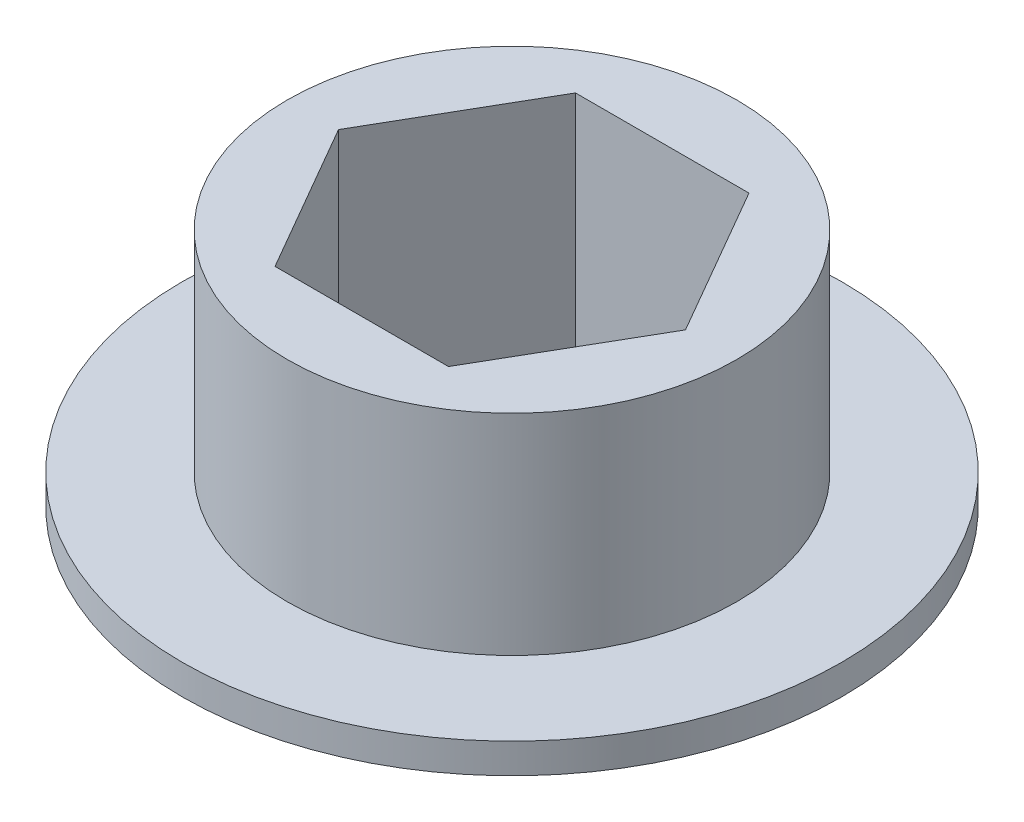
ISO-10303-21;
HEADER;
FILE_DESCRIPTION(('STEP AP214'),'2;1');
FILE_NAME('part.step','',(''),(''),'','','');
FILE_SCHEMA(('AUTOMOTIVE_DESIGN { 1 0 10303 214 1 1 1 1 }'));
ENDSEC;
DATA;
#1=APPLICATION_CONTEXT('core data for automotive mechanical design processes');
#2=APPLICATION_PROTOCOL_DEFINITION('international standard','automotive_design',2000,#1);
#3=PRODUCT_CONTEXT('',#1,'mechanical');
#4=PRODUCT('Part','Part','',(#3));
#5=PRODUCT_RELATED_PRODUCT_CATEGORY('part','',(#4));
#6=PRODUCT_DEFINITION_FORMATION('','',#4);
#7=PRODUCT_DEFINITION_CONTEXT('part definition',#1,'design');
#8=PRODUCT_DEFINITION('design','',#6,#7);
#9=PRODUCT_DEFINITION_SHAPE('','',#8);
#10=(LENGTH_UNIT() NAMED_UNIT(*) SI_UNIT(.MILLI.,.METRE.));
#11=(NAMED_UNIT(*) PLANE_ANGLE_UNIT() SI_UNIT($,.RADIAN.));
#12=(NAMED_UNIT(*) SI_UNIT($,.STERADIAN.) SOLID_ANGLE_UNIT());
#13=UNCERTAINTY_MEASURE_WITH_UNIT(LENGTH_MEASURE(1.E-05),#10,'distance_accuracy_value','');
#14=(GEOMETRIC_REPRESENTATION_CONTEXT(3) GLOBAL_UNCERTAINTY_ASSIGNED_CONTEXT((#13)) GLOBAL_UNIT_ASSIGNED_CONTEXT((#10,
#11,#12)) REPRESENTATION_CONTEXT('',''));
#15=CARTESIAN_POINT('',(0.,0.,0.));
#16=DIRECTION('',(0.,0.,1.));
#17=DIRECTION('',(1.,0.,0.));
#18=AXIS2_PLACEMENT_3D('',#15,#16,#17);
#19=CARTESIAN_POINT('',(0.,4.,0.));
#20=DIRECTION('',(0.,-1.,0.));
#21=DIRECTION('',(0.,0.,-1.));
#22=AXIS2_PLACEMENT_3D('',#19,#20,#21);
#23=CYLINDRICAL_SURFACE('',#22,7.5);
#24=CARTESIAN_POINT('',(0.,4.,0.));
#25=DIRECTION('',(0.,1.,0.));
#26=DIRECTION('',(0.,0.,1.));
#27=AXIS2_PLACEMENT_3D('',#24,#25,#26);
#28=CIRCLE('',#27,7.5);
#29=CARTESIAN_POINT('',(0.,4.,7.5));
#30=VERTEX_POINT('',#29);
#31=EDGE_CURVE('E46',#30,#30,#28,.T.);
#32=ORIENTED_EDGE('',*,*,#31,.F.);
#33=EDGE_LOOP('',(#32));
#34=FACE_BOUND('',#33,.T.);
#35=CARTESIAN_POINT('',(0.,-3.,0.));
#36=DIRECTION('',(0.,-1.,0.));
#37=DIRECTION('',(0.,0.,-1.));
#38=AXIS2_PLACEMENT_3D('',#35,#36,#37);
#39=CIRCLE('',#38,7.5);
#40=CARTESIAN_POINT('',(0.,-3.,-7.5));
#41=VERTEX_POINT('',#40);
#42=EDGE_CURVE('E11',#41,#41,#39,.T.);
#43=ORIENTED_EDGE('',*,*,#42,.F.);
#44=EDGE_LOOP('',(#43));
#45=FACE_BOUND('',#44,.T.);
#46=ADVANCED_FACE('F39',(#34,#45),#23,.T.);
#47=CARTESIAN_POINT('',(0.,4.,0.));
#48=DIRECTION('',(0.,1.,0.));
#49=DIRECTION('',(0.,0.,1.));
#50=AXIS2_PLACEMENT_3D('',#47,#48,#49);
#51=PLANE('',#50);
#52=ORIENTED_EDGE('',*,*,#31,.T.);
#53=EDGE_LOOP('',(#52));
#54=FACE_BOUND('',#53,.T.);
#55=DIRECTION('',(1.,0.,0.));
#56=VECTOR('',#55,1.);
#57=CARTESIAN_POINT('',(-2.89396822431298,4.,5.0125));
#58=LINE('',#57,#56);
#59=CARTESIAN_POINT('',(-2.89396822431298,4.,5.0125));
#60=VERTEX_POINT('',#59);
#61=CARTESIAN_POINT('',(2.89396822431301,4.,5.0125));
#62=VERTEX_POINT('',#61);
#63=EDGE_CURVE('E99',#60,#62,#58,.T.);
#64=ORIENTED_EDGE('',*,*,#63,.F.);
#65=DIRECTION('',(0.499999999999998,0.,0.86602540378444));
#66=VECTOR('',#65,1.);
#67=CARTESIAN_POINT('',(-5.78793644862597,4.,0.));
#68=LINE('',#67,#66);
#69=CARTESIAN_POINT('',(-5.78793644862597,4.,0.));
#70=VERTEX_POINT('',#69);
#71=EDGE_CURVE('E91',#70,#60,#68,.T.);
#72=ORIENTED_EDGE('',*,*,#71,.F.);
#73=DIRECTION('',(-0.499999999999998,0.,0.86602540378444));
#74=VECTOR('',#73,1.);
#75=CARTESIAN_POINT('',(-2.89396822431299,4.,-5.0125));
#76=LINE('',#75,#74);
#77=CARTESIAN_POINT('',(-2.89396822431299,4.,-5.0125));
#78=VERTEX_POINT('',#77);
#79=EDGE_CURVE('E121',#78,#70,#76,.T.);
#80=ORIENTED_EDGE('',*,*,#79,.F.);
#81=DIRECTION('',(-1.,0.,0.));
#82=VECTOR('',#81,1.);
#83=CARTESIAN_POINT('',(2.89396822431299,4.,-5.0125));
#84=LINE('',#83,#82);
#85=CARTESIAN_POINT('',(2.89396822431299,4.,-5.0125));
#86=VERTEX_POINT('',#85);
#87=EDGE_CURVE('E119',#86,#78,#84,.T.);
#88=ORIENTED_EDGE('',*,*,#87,.F.);
#89=DIRECTION('',(-0.499999999999998,0.,-0.86602540378444));
#90=VECTOR('',#89,1.);
#91=CARTESIAN_POINT('',(5.78793644862597,4.,0.));
#92=LINE('',#91,#90);
#93=CARTESIAN_POINT('',(5.78793644862597,4.,0.));
#94=VERTEX_POINT('',#93);
#95=EDGE_CURVE('E114',#94,#86,#92,.T.);
#96=ORIENTED_EDGE('',*,*,#95,.F.);
#97=DIRECTION('',(0.499999999999996,0.,-0.866025403784441));
#98=VECTOR('',#97,1.);
#99=CARTESIAN_POINT('',(2.89396822431301,4.,5.0125));
#100=LINE('',#99,#98);
#101=EDGE_CURVE('E112',#62,#94,#100,.T.);
#102=ORIENTED_EDGE('',*,*,#101,.F.);
#103=EDGE_LOOP('',(#64,#72,#80,#88,#96,#102));
#104=FACE_BOUND('',#103,.T.);
#105=ADVANCED_FACE('F110',(#54,#104),#51,.T.);
#106=CARTESIAN_POINT('',(0.,-4.,0.));
#107=DIRECTION('',(0.,1.,0.));
#108=DIRECTION('',(0.,0.,1.));
#109=AXIS2_PLACEMENT_3D('',#106,#107,#108);
#110=PLANE('',#109);
#111=DIRECTION('',(0.499999999999998,0.,0.86602540378444));
#112=VECTOR('',#111,1.);
#113=CARTESIAN_POINT('',(-5.78793644862597,-4.,0.));
#114=LINE('',#113,#112);
#115=CARTESIAN_POINT('',(-5.78793644862597,-4.,0.));
#116=VERTEX_POINT('',#115);
#117=CARTESIAN_POINT('',(-2.89396822431298,-4.,5.0125));
#118=VERTEX_POINT('',#117);
#119=EDGE_CURVE('E61',#116,#118,#114,.T.);
#120=ORIENTED_EDGE('',*,*,#119,.T.);
#121=DIRECTION('',(1.,0.,0.));
#122=VECTOR('',#121,1.);
#123=CARTESIAN_POINT('',(-2.89396822431298,-4.,5.0125));
#124=LINE('',#123,#122);
#125=CARTESIAN_POINT('',(2.89396822431301,-4.,5.0125));
#126=VERTEX_POINT('',#125);
#127=EDGE_CURVE('E106',#118,#126,#124,.T.);
#128=ORIENTED_EDGE('',*,*,#127,.T.);
#129=DIRECTION('',(0.499999999999996,0.,-0.866025403784441));
#130=VECTOR('',#129,1.);
#131=CARTESIAN_POINT('',(2.89396822431301,-4.,5.0125));
#132=LINE('',#131,#130);
#133=CARTESIAN_POINT('',(5.78793644862597,-4.,0.));
#134=VERTEX_POINT('',#133);
#135=EDGE_CURVE('E126',#126,#134,#132,.T.);
#136=ORIENTED_EDGE('',*,*,#135,.T.);
#137=DIRECTION('',(-0.499999999999998,0.,-0.86602540378444));
#138=VECTOR('',#137,1.);
#139=CARTESIAN_POINT('',(5.78793644862597,-4.,0.));
#140=LINE('',#139,#138);
#141=CARTESIAN_POINT('',(2.89396822431299,-4.,-5.0125));
#142=VERTEX_POINT('',#141);
#143=EDGE_CURVE('E129',#134,#142,#140,.T.);
#144=ORIENTED_EDGE('',*,*,#143,.T.);
#145=DIRECTION('',(-1.,0.,0.));
#146=VECTOR('',#145,1.);
#147=CARTESIAN_POINT('',(2.89396822431299,-4.,-5.0125));
#148=LINE('',#147,#146);
#149=CARTESIAN_POINT('',(-2.89396822431299,-4.,-5.0125));
#150=VERTEX_POINT('',#149);
#151=EDGE_CURVE('E132',#142,#150,#148,.T.);
#152=ORIENTED_EDGE('',*,*,#151,.T.);
#153=DIRECTION('',(-0.499999999999998,0.,0.86602540378444));
#154=VECTOR('',#153,1.);
#155=CARTESIAN_POINT('',(-2.89396822431299,-4.,-5.0125));
#156=LINE('',#155,#154);
#157=EDGE_CURVE('E100',#150,#116,#156,.T.);
#158=ORIENTED_EDGE('',*,*,#157,.T.);
#159=EDGE_LOOP('',(#120,#128,#136,#144,#152,#158));
#160=FACE_BOUND('',#159,.T.);
#161=CARTESIAN_POINT('',(0.,-4.,0.));
#162=DIRECTION('',(0.,-1.,0.));
#163=DIRECTION('',(0.,0.,-1.));
#164=AXIS2_PLACEMENT_3D('',#161,#162,#163);
#165=CIRCLE('',#164,11.);
#166=CARTESIAN_POINT('',(0.,-4.,-11.));
#167=VERTEX_POINT('',#166);
#168=EDGE_CURVE('E159',#167,#167,#165,.T.);
#169=ORIENTED_EDGE('',*,*,#168,.T.);
#170=EDGE_LOOP('',(#169));
#171=FACE_BOUND('',#170,.T.);
#172=ADVANCED_FACE('F164',(#160,#171),#110,.F.);
#173=CARTESIAN_POINT('',(-5.78793644862597,4.,0.));
#174=DIRECTION('',(0.86602540378444,0.,-0.499999999999998));
#175=DIRECTION('',(-0.499999999999998,0.,-0.86602540378444));
#176=AXIS2_PLACEMENT_3D('',#173,#174,#175);
#177=PLANE('',#176);
#178=ORIENTED_EDGE('',*,*,#119,.F.);
#179=DIRECTION('',(0.,-1.,0.));
#180=VECTOR('',#179,1.);
#181=CARTESIAN_POINT('',(-5.78793644862597,4.,0.));
#182=LINE('',#181,#180);
#183=EDGE_CURVE('E95',#70,#116,#182,.T.);
#184=ORIENTED_EDGE('',*,*,#183,.F.);
#185=ORIENTED_EDGE('',*,*,#71,.T.);
#186=DIRECTION('',(0.,-1.,0.));
#187=VECTOR('',#186,1.);
#188=CARTESIAN_POINT('',(-2.89396822431298,4.,5.0125));
#189=LINE('',#188,#187);
#190=EDGE_CURVE('E94',#60,#118,#189,.T.);
#191=ORIENTED_EDGE('',*,*,#190,.T.);
#192=EDGE_LOOP('',(#178,#184,#185,#191));
#193=FACE_BOUND('',#192,.T.);
#194=ADVANCED_FACE('F93',(#193),#177,.T.);
#195=CARTESIAN_POINT('',(-2.89396822431298,4.,5.0125));
#196=DIRECTION('',(0.,0.,-1.));
#197=DIRECTION('',(-1.,0.,0.));
#198=AXIS2_PLACEMENT_3D('',#195,#196,#197);
#199=PLANE('',#198);
#200=ORIENTED_EDGE('',*,*,#127,.F.);
#201=ORIENTED_EDGE('',*,*,#190,.F.);
#202=ORIENTED_EDGE('',*,*,#63,.T.);
#203=DIRECTION('',(0.,-1.,0.));
#204=VECTOR('',#203,1.);
#205=CARTESIAN_POINT('',(2.89396822431301,4.,5.0125));
#206=LINE('',#205,#204);
#207=EDGE_CURVE('E107',#62,#126,#206,.T.);
#208=ORIENTED_EDGE('',*,*,#207,.T.);
#209=EDGE_LOOP('',(#200,#201,#202,#208));
#210=FACE_BOUND('',#209,.T.);
#211=ADVANCED_FACE('F103',(#210),#199,.T.);
#212=CARTESIAN_POINT('',(2.89396822431301,4.,5.0125));
#213=DIRECTION('',(-0.866025403784441,0.,-0.499999999999996));
#214=DIRECTION('',(-0.499999999999996,0.,0.866025403784441));
#215=AXIS2_PLACEMENT_3D('',#212,#213,#214);
#216=PLANE('',#215);
#217=ORIENTED_EDGE('',*,*,#135,.F.);
#218=ORIENTED_EDGE('',*,*,#207,.F.);
#219=ORIENTED_EDGE('',*,*,#101,.T.);
#220=DIRECTION('',(0.,-1.,0.));
#221=VECTOR('',#220,1.);
#222=CARTESIAN_POINT('',(5.78793644862597,4.,0.));
#223=LINE('',#222,#221);
#224=EDGE_CURVE('E141',#94,#134,#223,.T.);
#225=ORIENTED_EDGE('',*,*,#224,.T.);
#226=EDGE_LOOP('',(#217,#218,#219,#225));
#227=FACE_BOUND('',#226,.T.);
#228=ADVANCED_FACE('F182',(#227),#216,.T.);
#229=CARTESIAN_POINT('',(5.78793644862597,4.,0.));
#230=DIRECTION('',(-0.86602540378444,0.,0.499999999999998));
#231=DIRECTION('',(0.499999999999998,0.,0.86602540378444));
#232=AXIS2_PLACEMENT_3D('',#229,#230,#231);
#233=PLANE('',#232);
#234=ORIENTED_EDGE('',*,*,#143,.F.);
#235=ORIENTED_EDGE('',*,*,#224,.F.);
#236=ORIENTED_EDGE('',*,*,#95,.T.);
#237=DIRECTION('',(0.,-1.,0.));
#238=VECTOR('',#237,1.);
#239=CARTESIAN_POINT('',(2.89396822431299,4.,-5.0125));
#240=LINE('',#239,#238);
#241=EDGE_CURVE('E139',#86,#142,#240,.T.);
#242=ORIENTED_EDGE('',*,*,#241,.T.);
#243=EDGE_LOOP('',(#234,#235,#236,#242));
#244=FACE_BOUND('',#243,.T.);
#245=ADVANCED_FACE('F178',(#244),#233,.T.);
#246=CARTESIAN_POINT('',(2.89396822431299,4.,-5.0125));
#247=DIRECTION('',(0.,0.,1.));
#248=DIRECTION('',(1.,0.,0.));
#249=AXIS2_PLACEMENT_3D('',#246,#247,#248);
#250=PLANE('',#249);
#251=ORIENTED_EDGE('',*,*,#151,.F.);
#252=ORIENTED_EDGE('',*,*,#241,.F.);
#253=ORIENTED_EDGE('',*,*,#87,.T.);
#254=DIRECTION('',(0.,-1.,0.));
#255=VECTOR('',#254,1.);
#256=CARTESIAN_POINT('',(-2.89396822431299,4.,-5.0125));
#257=LINE('',#256,#255);
#258=EDGE_CURVE('E53',#78,#150,#257,.T.);
#259=ORIENTED_EDGE('',*,*,#258,.T.);
#260=EDGE_LOOP('',(#251,#252,#253,#259));
#261=FACE_BOUND('',#260,.T.);
#262=ADVANCED_FACE('F173',(#261),#250,.T.);
#263=CARTESIAN_POINT('',(-2.89396822431299,4.,-5.0125));
#264=DIRECTION('',(0.86602540378444,0.,0.499999999999998));
#265=DIRECTION('',(0.499999999999998,0.,-0.86602540378444));
#266=AXIS2_PLACEMENT_3D('',#263,#264,#265);
#267=PLANE('',#266);
#268=ORIENTED_EDGE('',*,*,#157,.F.);
#269=ORIENTED_EDGE('',*,*,#258,.F.);
#270=ORIENTED_EDGE('',*,*,#79,.T.);
#271=ORIENTED_EDGE('',*,*,#183,.T.);
#272=EDGE_LOOP('',(#268,#269,#270,#271));
#273=FACE_BOUND('',#272,.T.);
#274=ADVANCED_FACE('F167',(#273),#267,.T.);
#275=CARTESIAN_POINT('',(0.,-3.,0.));
#276=DIRECTION('',(0.,-1.,0.));
#277=DIRECTION('',(0.,0.,-1.));
#278=AXIS2_PLACEMENT_3D('',#275,#276,#277);
#279=CYLINDRICAL_SURFACE('',#278,11.);
#280=CARTESIAN_POINT('',(0.,-3.,0.));
#281=DIRECTION('',(0.,-1.,0.));
#282=DIRECTION('',(0.,0.,-1.));
#283=AXIS2_PLACEMENT_3D('',#280,#281,#282);
#284=CIRCLE('',#283,11.);
#285=CARTESIAN_POINT('',(0.,-3.,-11.));
#286=VERTEX_POINT('',#285);
#287=EDGE_CURVE('E124',#286,#286,#284,.T.);
#288=ORIENTED_EDGE('',*,*,#287,.T.);
#289=EDGE_LOOP('',(#288));
#290=FACE_BOUND('',#289,.T.);
#291=ORIENTED_EDGE('',*,*,#168,.F.);
#292=EDGE_LOOP('',(#291));
#293=FACE_BOUND('',#292,.T.);
#294=ADVANCED_FACE('F154',(#290,#293),#279,.T.);
#295=CARTESIAN_POINT('',(0.,-3.,0.));
#296=DIRECTION('',(0.,-1.,0.));
#297=DIRECTION('',(0.,0.,-1.));
#298=AXIS2_PLACEMENT_3D('',#295,#296,#297);
#299=PLANE('',#298);
#300=ORIENTED_EDGE('',*,*,#42,.T.);
#301=EDGE_LOOP('',(#300));
#302=FACE_BOUND('',#301,.T.);
#303=ORIENTED_EDGE('',*,*,#287,.F.);
#304=EDGE_LOOP('',(#303));
#305=FACE_BOUND('',#304,.T.);
#306=ADVANCED_FACE('F151',(#302,#305),#299,.F.);
#307=CLOSED_SHELL('',(#46,#105,#172,#194,#211,#228,#245,#262,#274,#294,#306));
#308=MANIFOLD_SOLID_BREP('B2',#307);
#309=ADVANCED_BREP_SHAPE_REPRESENTATION('',(#18,#308),#14);
#310=SHAPE_DEFINITION_REPRESENTATION(#9,#309);
ENDSEC;
END-ISO-10303-21;
